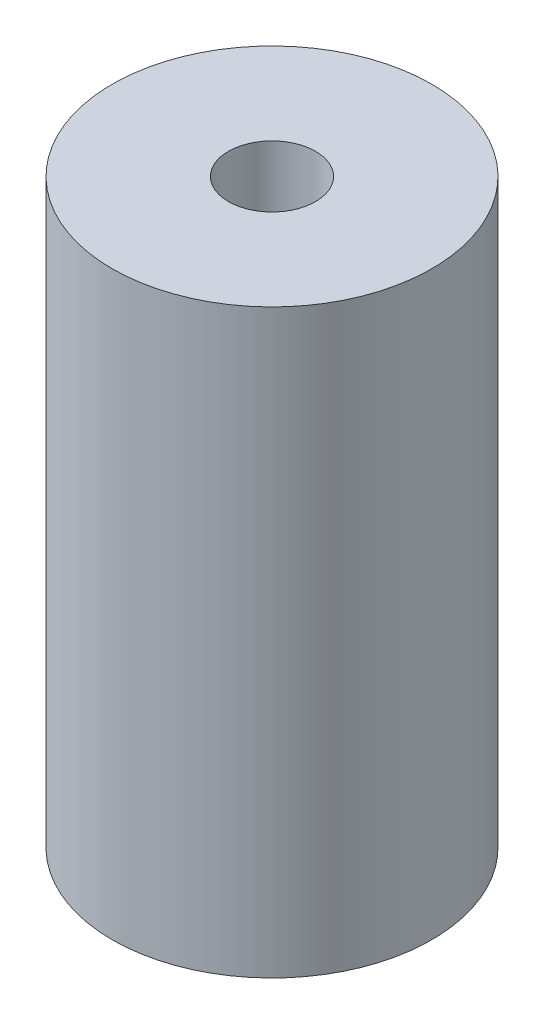
ISO-10303-21;
HEADER;
FILE_DESCRIPTION(('STEP AP214'),'2;1');
FILE_NAME('part.step','',(''),(''),'','','');
FILE_SCHEMA(('AUTOMOTIVE_DESIGN { 1 0 10303 214 1 1 1 1 }'));
ENDSEC;
DATA;
#1=APPLICATION_CONTEXT('core data for automotive mechanical design processes');
#2=APPLICATION_PROTOCOL_DEFINITION('international standard','automotive_design',2000,#1);
#3=PRODUCT_CONTEXT('',#1,'mechanical');
#4=PRODUCT('Part','Part','',(#3));
#5=PRODUCT_RELATED_PRODUCT_CATEGORY('part','',(#4));
#6=PRODUCT_DEFINITION_FORMATION('','',#4);
#7=PRODUCT_DEFINITION_CONTEXT('part definition',#1,'design');
#8=PRODUCT_DEFINITION('design','',#6,#7);
#9=PRODUCT_DEFINITION_SHAPE('','',#8);
#10=(LENGTH_UNIT() NAMED_UNIT(*) SI_UNIT(.MILLI.,.METRE.));
#11=(NAMED_UNIT(*) PLANE_ANGLE_UNIT() SI_UNIT($,.RADIAN.));
#12=(NAMED_UNIT(*) SI_UNIT($,.STERADIAN.) SOLID_ANGLE_UNIT());
#13=UNCERTAINTY_MEASURE_WITH_UNIT(LENGTH_MEASURE(1.E-05),#10,'distance_accuracy_value','');
#14=(GEOMETRIC_REPRESENTATION_CONTEXT(3) GLOBAL_UNCERTAINTY_ASSIGNED_CONTEXT((#13)) GLOBAL_UNIT_ASSIGNED_CONTEXT((#10,
#11,#12)) REPRESENTATION_CONTEXT('',''));
#15=CARTESIAN_POINT('',(0.,0.,0.));
#16=DIRECTION('',(0.,0.,1.));
#17=DIRECTION('',(1.,0.,0.));
#18=AXIS2_PLACEMENT_3D('',#15,#16,#17);
#19=CARTESIAN_POINT('',(0.,20.,0.));
#20=DIRECTION('',(0.,1.,0.));
#21=DIRECTION('',(0.,0.,1.));
#22=AXIS2_PLACEMENT_3D('',#19,#20,#21);
#23=PLANE('',#22);
#24=CARTESIAN_POINT('',(0.,20.,0.));
#25=DIRECTION('',(0.,1.,0.));
#26=DIRECTION('',(0.,0.,1.));
#27=AXIS2_PLACEMENT_3D('',#24,#25,#26);
#28=CIRCLE('',#27,5.5);
#29=CARTESIAN_POINT('',(0.,20.,5.5));
#30=VERTEX_POINT('',#29);
#31=EDGE_CURVE('E10',#30,#30,#28,.T.);
#32=ORIENTED_EDGE('',*,*,#31,.T.);
#33=EDGE_LOOP('',(#32));
#34=FACE_BOUND('',#33,.T.);
#35=CARTESIAN_POINT('',(0.,20.,0.));
#36=DIRECTION('',(0.,1.,0.));
#37=DIRECTION('',(0.,0.,1.));
#38=AXIS2_PLACEMENT_3D('',#35,#36,#37);
#39=CIRCLE('',#38,1.5);
#40=CARTESIAN_POINT('',(0.,20.,1.5));
#41=VERTEX_POINT('',#40);
#42=EDGE_CURVE('E50',#41,#41,#39,.T.);
#43=ORIENTED_EDGE('',*,*,#42,.F.);
#44=EDGE_LOOP('',(#43));
#45=FACE_BOUND('',#44,.T.);
#46=ADVANCED_FACE('F37',(#34,#45),#23,.T.);
#47=CARTESIAN_POINT('',(0.,0.,0.));
#48=DIRECTION('',(0.,1.,0.));
#49=DIRECTION('',(0.,0.,1.));
#50=AXIS2_PLACEMENT_3D('',#47,#48,#49);
#51=PLANE('',#50);
#52=CARTESIAN_POINT('',(0.,0.,0.));
#53=DIRECTION('',(0.,1.,0.));
#54=DIRECTION('',(0.,0.,1.));
#55=AXIS2_PLACEMENT_3D('',#52,#53,#54);
#56=CIRCLE('',#55,5.5);
#57=CARTESIAN_POINT('',(0.,0.,5.5));
#58=VERTEX_POINT('',#57);
#59=EDGE_CURVE('E41',#58,#58,#56,.T.);
#60=ORIENTED_EDGE('',*,*,#59,.F.);
#61=EDGE_LOOP('',(#60));
#62=FACE_BOUND('',#61,.T.);
#63=CARTESIAN_POINT('',(0.,0.,0.));
#64=DIRECTION('',(0.,1.,0.));
#65=DIRECTION('',(0.,0.,1.));
#66=AXIS2_PLACEMENT_3D('',#63,#64,#65);
#67=CIRCLE('',#66,1.5);
#68=CARTESIAN_POINT('',(0.,0.,1.5));
#69=VERTEX_POINT('',#68);
#70=EDGE_CURVE('E52',#69,#69,#67,.T.);
#71=ORIENTED_EDGE('',*,*,#70,.T.);
#72=EDGE_LOOP('',(#71));
#73=FACE_BOUND('',#72,.T.);
#74=ADVANCED_FACE('F64',(#62,#73),#51,.F.);
#75=CARTESIAN_POINT('',(0.,20.,0.));
#76=DIRECTION('',(0.,-1.,0.));
#77=DIRECTION('',(0.,0.,-1.));
#78=AXIS2_PLACEMENT_3D('',#75,#76,#77);
#79=CYLINDRICAL_SURFACE('',#78,5.5);
#80=ORIENTED_EDGE('',*,*,#31,.F.);
#81=EDGE_LOOP('',(#80));
#82=FACE_BOUND('',#81,.T.);
#83=ORIENTED_EDGE('',*,*,#59,.T.);
#84=EDGE_LOOP('',(#83));
#85=FACE_BOUND('',#84,.T.);
#86=ADVANCED_FACE('F39',(#82,#85),#79,.T.);
#87=CARTESIAN_POINT('',(0.,20.,0.));
#88=DIRECTION('',(0.,-1.,0.));
#89=DIRECTION('',(0.,0.,-1.));
#90=AXIS2_PLACEMENT_3D('',#87,#88,#89);
#91=CYLINDRICAL_SURFACE('',#90,1.5);
#92=ORIENTED_EDGE('',*,*,#42,.T.);
#93=EDGE_LOOP('',(#92));
#94=FACE_BOUND('',#93,.T.);
#95=ORIENTED_EDGE('',*,*,#70,.F.);
#96=EDGE_LOOP('',(#95));
#97=FACE_BOUND('',#96,.T.);
#98=ADVANCED_FACE('F60',(#94,#97),#91,.F.);
#99=CLOSED_SHELL('',(#46,#74,#86,#98));
#100=MANIFOLD_SOLID_BREP('B2',#99);
#101=ADVANCED_BREP_SHAPE_REPRESENTATION('',(#18,#100),#14);
#102=SHAPE_DEFINITION_REPRESENTATION(#9,#101);
ENDSEC;
END-ISO-10303-21;
